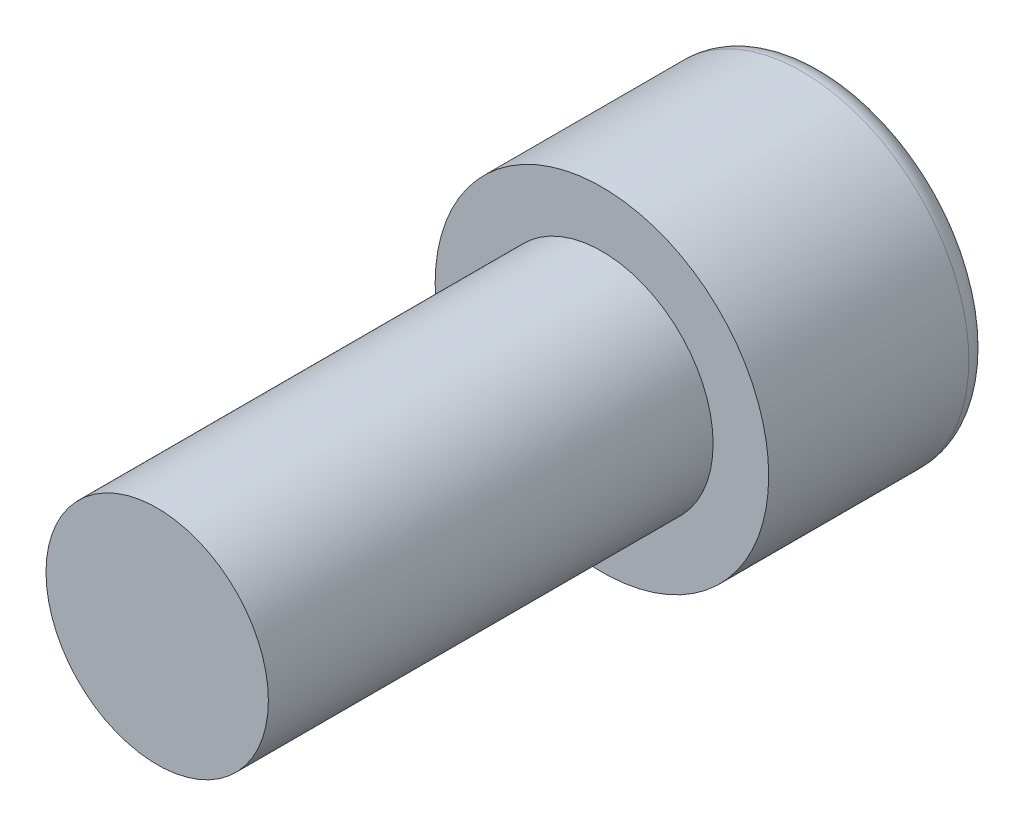
ISO-10303-21;
HEADER;
FILE_DESCRIPTION(('STEP AP214'),'2;1');
FILE_NAME('part.step','',(''),(''),'','','');
FILE_SCHEMA(('AUTOMOTIVE_DESIGN { 1 0 10303 214 1 1 1 1 }'));
ENDSEC;
DATA;
#1=APPLICATION_CONTEXT('core data for automotive mechanical design processes');
#2=APPLICATION_PROTOCOL_DEFINITION('international standard','automotive_design',2000,#1);
#3=PRODUCT_CONTEXT('',#1,'mechanical');
#4=PRODUCT('Part','Part','',(#3));
#5=PRODUCT_RELATED_PRODUCT_CATEGORY('part','',(#4));
#6=PRODUCT_DEFINITION_FORMATION('','',#4);
#7=PRODUCT_DEFINITION_CONTEXT('part definition',#1,'design');
#8=PRODUCT_DEFINITION('design','',#6,#7);
#9=PRODUCT_DEFINITION_SHAPE('','',#8);
#10=(LENGTH_UNIT() NAMED_UNIT(*) SI_UNIT(.MILLI.,.METRE.));
#11=(NAMED_UNIT(*) PLANE_ANGLE_UNIT() SI_UNIT($,.RADIAN.));
#12=(NAMED_UNIT(*) SI_UNIT($,.STERADIAN.) SOLID_ANGLE_UNIT());
#13=UNCERTAINTY_MEASURE_WITH_UNIT(LENGTH_MEASURE(1.E-05),#10,'distance_accuracy_value','');
#14=(GEOMETRIC_REPRESENTATION_CONTEXT(3) GLOBAL_UNCERTAINTY_ASSIGNED_CONTEXT((#13)) GLOBAL_UNIT_ASSIGNED_CONTEXT((#10,
#11,#12)) REPRESENTATION_CONTEXT('',''));
#15=CARTESIAN_POINT('',(0.,0.,0.));
#16=DIRECTION('',(0.,0.,1.));
#17=DIRECTION('',(1.,0.,0.));
#18=AXIS2_PLACEMENT_3D('',#15,#16,#17);
#19=CARTESIAN_POINT('',(0.,0.,4.));
#20=DIRECTION('',(0.,0.,-1.));
#21=DIRECTION('',(-1.,0.,0.));
#22=AXIS2_PLACEMENT_3D('',#19,#20,#21);
#23=CYLINDRICAL_SURFACE('',#22,1.);
#24=CARTESIAN_POINT('',(0.,0.,4.));
#25=DIRECTION('',(0.,0.,1.));
#26=DIRECTION('',(1.,0.,0.));
#27=AXIS2_PLACEMENT_3D('',#24,#25,#26);
#28=CIRCLE('',#27,1.);
#29=CARTESIAN_POINT('',(1.,0.,4.));
#30=VERTEX_POINT('',#29);
#31=EDGE_CURVE('E149',#30,#30,#28,.T.);
#32=ORIENTED_EDGE('',*,*,#31,.F.);
#33=EDGE_LOOP('',(#32));
#34=FACE_BOUND('',#33,.T.);
#35=CARTESIAN_POINT('',(0.,0.,0.));
#36=DIRECTION('',(0.,0.,1.));
#37=DIRECTION('',(1.,0.,0.));
#38=AXIS2_PLACEMENT_3D('',#35,#36,#37);
#39=CIRCLE('',#38,1.);
#40=CARTESIAN_POINT('',(1.,0.,0.));
#41=VERTEX_POINT('',#40);
#42=EDGE_CURVE('E148',#41,#41,#39,.T.);
#43=ORIENTED_EDGE('',*,*,#42,.T.);
#44=EDGE_LOOP('',(#43));
#45=FACE_BOUND('',#44,.T.);
#46=ADVANCED_FACE('F38',(#34,#45),#23,.T.);
#47=CARTESIAN_POINT('',(0.,0.,4.));
#48=DIRECTION('',(0.,0.,1.));
#49=DIRECTION('',(1.,0.,0.));
#50=AXIS2_PLACEMENT_3D('',#47,#48,#49);
#51=PLANE('',#50);
#52=ORIENTED_EDGE('',*,*,#31,.T.);
#53=EDGE_LOOP('',(#52));
#54=FACE_BOUND('',#53,.T.);
#55=ADVANCED_FACE('F172',(#54),#51,.T.);
#56=CARTESIAN_POINT('',(0.,0.,-2.));
#57=DIRECTION('',(0.,0.,1.));
#58=DIRECTION('',(1.,0.,0.));
#59=AXIS2_PLACEMENT_3D('',#56,#57,#58);
#60=CYLINDRICAL_SURFACE('',#59,1.5);
#61=CARTESIAN_POINT('',(0.,0.,-1.8));
#62=DIRECTION('',(0.,0.,-1.));
#63=DIRECTION('',(-1.,0.,0.));
#64=AXIS2_PLACEMENT_3D('',#61,#62,#63);
#65=CIRCLE('',#64,1.5);
#66=CARTESIAN_POINT('',(-1.5,0.,-1.8));
#67=VERTEX_POINT('',#66);
#68=EDGE_CURVE('E11',#67,#67,#65,.F.);
#69=ORIENTED_EDGE('',*,*,#68,.T.);
#70=EDGE_LOOP('',(#69));
#71=FACE_BOUND('',#70,.T.);
#72=CARTESIAN_POINT('',(0.,0.,0.));
#73=DIRECTION('',(0.,0.,-1.));
#74=DIRECTION('',(-1.,0.,0.));
#75=AXIS2_PLACEMENT_3D('',#72,#73,#74);
#76=CIRCLE('',#75,1.5);
#77=CARTESIAN_POINT('',(-1.5,0.,0.));
#78=VERTEX_POINT('',#77);
#79=EDGE_CURVE('E140',#78,#78,#76,.T.);
#80=ORIENTED_EDGE('',*,*,#79,.T.);
#81=EDGE_LOOP('',(#80));
#82=FACE_BOUND('',#81,.T.);
#83=ADVANCED_FACE('F177',(#71,#82),#60,.T.);
#84=CARTESIAN_POINT('',(0.,0.,-2.));
#85=DIRECTION('',(0.,0.,-1.));
#86=DIRECTION('',(-1.,0.,0.));
#87=AXIS2_PLACEMENT_3D('',#84,#85,#86);
#88=PLANE('',#87);
#89=DIRECTION('',(-0.866025403784439,-0.5,0.));
#90=VECTOR('',#89,1.);
#91=CARTESIAN_POINT('',(0.75,-0.433012701892219,-2.));
#92=LINE('',#91,#90);
#93=CARTESIAN_POINT('',(0.75,-0.433012701892219,-2.));
#94=VERTEX_POINT('',#93);
#95=CARTESIAN_POINT('',(0.,-0.866025403784439,-2.));
#96=VERTEX_POINT('',#95);
#97=EDGE_CURVE('E53',#94,#96,#92,.T.);
#98=ORIENTED_EDGE('',*,*,#97,.F.);
#99=DIRECTION('',(0.,-1.,0.));
#100=VECTOR('',#99,1.);
#101=CARTESIAN_POINT('',(0.75,0.433012701892219,-2.));
#102=LINE('',#101,#100);
#103=CARTESIAN_POINT('',(0.75,0.433012701892219,-2.));
#104=VERTEX_POINT('',#103);
#105=EDGE_CURVE('E136',#104,#94,#102,.T.);
#106=ORIENTED_EDGE('',*,*,#105,.F.);
#107=DIRECTION('',(0.866025403784439,-0.5,0.));
#108=VECTOR('',#107,1.);
#109=CARTESIAN_POINT('',(0.,0.866025403784439,-2.));
#110=LINE('',#109,#108);
#111=CARTESIAN_POINT('',(0.,0.866025403784439,-2.));
#112=VERTEX_POINT('',#111);
#113=EDGE_CURVE('E134',#112,#104,#110,.T.);
#114=ORIENTED_EDGE('',*,*,#113,.F.);
#115=DIRECTION('',(0.866025403784439,0.5,0.));
#116=VECTOR('',#115,1.);
#117=CARTESIAN_POINT('',(-0.75,0.43301270189222,-2.));
#118=LINE('',#117,#116);
#119=CARTESIAN_POINT('',(-0.75,0.43301270189222,-2.));
#120=VERTEX_POINT('',#119);
#121=EDGE_CURVE('E101',#120,#112,#118,.T.);
#122=ORIENTED_EDGE('',*,*,#121,.F.);
#123=DIRECTION('',(0.,1.,0.));
#124=VECTOR('',#123,1.);
#125=CARTESIAN_POINT('',(-0.75,-0.433012701892219,-2.));
#126=LINE('',#125,#124);
#127=CARTESIAN_POINT('',(-0.75,-0.433012701892219,-2.));
#128=VERTEX_POINT('',#127);
#129=EDGE_CURVE('E130',#128,#120,#126,.T.);
#130=ORIENTED_EDGE('',*,*,#129,.F.);
#131=DIRECTION('',(-0.866025403784438,0.5,0.));
#132=VECTOR('',#131,1.);
#133=CARTESIAN_POINT('',(0.,-0.866025403784439,-2.));
#134=LINE('',#133,#132);
#135=EDGE_CURVE('E127',#96,#128,#134,.T.);
#136=ORIENTED_EDGE('',*,*,#135,.F.);
#137=EDGE_LOOP('',(#98,#106,#114,#122,#130,#136));
#138=FACE_BOUND('',#137,.T.);
#139=CARTESIAN_POINT('',(0.,0.,-2.));
#140=DIRECTION('',(0.,0.,-1.));
#141=DIRECTION('',(-1.,0.,0.));
#142=AXIS2_PLACEMENT_3D('',#139,#140,#141);
#143=CIRCLE('',#142,1.3);
#144=CARTESIAN_POINT('',(-1.3,0.,-2.));
#145=VERTEX_POINT('',#144);
#146=EDGE_CURVE('E46',#145,#145,#143,.T.);
#147=ORIENTED_EDGE('',*,*,#146,.T.);
#148=EDGE_LOOP('',(#147));
#149=FACE_BOUND('',#148,.T.);
#150=ADVANCED_FACE('F156',(#138,#149),#88,.T.);
#151=CARTESIAN_POINT('',(0.,0.,0.));
#152=DIRECTION('',(0.,0.,-1.));
#153=DIRECTION('',(-1.,0.,0.));
#154=AXIS2_PLACEMENT_3D('',#151,#152,#153);
#155=PLANE('',#154);
#156=ORIENTED_EDGE('',*,*,#42,.F.);
#157=EDGE_LOOP('',(#156));
#158=FACE_BOUND('',#157,.T.);
#159=ORIENTED_EDGE('',*,*,#79,.F.);
#160=EDGE_LOOP('',(#159));
#161=FACE_BOUND('',#160,.T.);
#162=ADVANCED_FACE('F160',(#158,#161),#155,.F.);
#163=CARTESIAN_POINT('',(0.,0.,-1.8));
#164=DIRECTION('',(0.,0.,-1.));
#165=DIRECTION('',(-1.,0.,0.));
#166=AXIS2_PLACEMENT_3D('',#163,#164,#165);
#167=TOROIDAL_SURFACE('',#166,1.3,0.2);
#168=ORIENTED_EDGE('',*,*,#68,.F.);
#169=EDGE_LOOP('',(#168));
#170=FACE_BOUND('',#169,.T.);
#171=ORIENTED_EDGE('',*,*,#146,.F.);
#172=EDGE_LOOP('',(#171));
#173=FACE_BOUND('',#172,.T.);
#174=ADVANCED_FACE('F40',(#170,#173),#167,.T.);
#175=CARTESIAN_POINT('',(0.75,-0.433012701892219,-0.2));
#176=DIRECTION('',(0.5,-0.866025403784438,0.));
#177=DIRECTION('',(0.866025403784439,0.5,0.));
#178=AXIS2_PLACEMENT_3D('',#175,#176,#177);
#179=PLANE('',#178);
#180=ORIENTED_EDGE('',*,*,#97,.T.);
#181=DIRECTION('',(0.,0.,-1.));
#182=VECTOR('',#181,1.);
#183=CARTESIAN_POINT('',(0.,-0.866025403784439,-0.2));
#184=LINE('',#183,#182);
#185=CARTESIAN_POINT('',(0.,-0.866025403784439,-0.2));
#186=VERTEX_POINT('',#185);
#187=EDGE_CURVE('E83',#186,#96,#184,.T.);
#188=ORIENTED_EDGE('',*,*,#187,.F.);
#189=DIRECTION('',(-0.866025403784439,-0.5,0.));
#190=VECTOR('',#189,1.);
#191=CARTESIAN_POINT('',(0.75,-0.433012701892219,-0.2));
#192=LINE('',#191,#190);
#193=CARTESIAN_POINT('',(0.75,-0.433012701892219,-0.2));
#194=VERTEX_POINT('',#193);
#195=EDGE_CURVE('E138',#194,#186,#192,.T.);
#196=ORIENTED_EDGE('',*,*,#195,.F.);
#197=DIRECTION('',(0.,0.,-1.));
#198=VECTOR('',#197,1.);
#199=CARTESIAN_POINT('',(0.75,-0.433012701892219,-0.2));
#200=LINE('',#199,#198);
#201=EDGE_CURVE('E61',#194,#94,#200,.T.);
#202=ORIENTED_EDGE('',*,*,#201,.T.);
#203=EDGE_LOOP('',(#180,#188,#196,#202));
#204=FACE_BOUND('',#203,.T.);
#205=ADVANCED_FACE('F159',(#204),#179,.F.);
#206=CARTESIAN_POINT('',(0.75,0.433012701892219,-0.2));
#207=DIRECTION('',(1.,0.,0.));
#208=DIRECTION('',(0.,1.,0.));
#209=AXIS2_PLACEMENT_3D('',#206,#207,#208);
#210=PLANE('',#209);
#211=ORIENTED_EDGE('',*,*,#105,.T.);
#212=ORIENTED_EDGE('',*,*,#201,.F.);
#213=DIRECTION('',(0.,-1.,0.));
#214=VECTOR('',#213,1.);
#215=CARTESIAN_POINT('',(0.75,0.433012701892219,-0.2));
#216=LINE('',#215,#214);
#217=CARTESIAN_POINT('',(0.75,0.433012701892219,-0.2));
#218=VERTEX_POINT('',#217);
#219=EDGE_CURVE('E113',#218,#194,#216,.T.);
#220=ORIENTED_EDGE('',*,*,#219,.F.);
#221=DIRECTION('',(0.,0.,-1.));
#222=VECTOR('',#221,1.);
#223=CARTESIAN_POINT('',(0.75,0.433012701892219,-0.2));
#224=LINE('',#223,#222);
#225=EDGE_CURVE('E105',#218,#104,#224,.T.);
#226=ORIENTED_EDGE('',*,*,#225,.T.);
#227=EDGE_LOOP('',(#211,#212,#220,#226));
#228=FACE_BOUND('',#227,.T.);
#229=ADVANCED_FACE('F166',(#228),#210,.F.);
#230=CARTESIAN_POINT('',(0.,0.866025403784439,-0.2));
#231=DIRECTION('',(0.5,0.866025403784438,0.));
#232=DIRECTION('',(-0.866025403784439,0.5,0.));
#233=AXIS2_PLACEMENT_3D('',#230,#231,#232);
#234=PLANE('',#233);
#235=ORIENTED_EDGE('',*,*,#113,.T.);
#236=ORIENTED_EDGE('',*,*,#225,.F.);
#237=DIRECTION('',(0.866025403784439,-0.5,0.));
#238=VECTOR('',#237,1.);
#239=CARTESIAN_POINT('',(0.,0.866025403784439,-0.2));
#240=LINE('',#239,#238);
#241=CARTESIAN_POINT('',(0.,0.866025403784439,-0.2));
#242=VERTEX_POINT('',#241);
#243=EDGE_CURVE('E109',#242,#218,#240,.T.);
#244=ORIENTED_EDGE('',*,*,#243,.F.);
#245=DIRECTION('',(0.,0.,-1.));
#246=VECTOR('',#245,1.);
#247=CARTESIAN_POINT('',(0.,0.866025403784439,-0.2));
#248=LINE('',#247,#246);
#249=EDGE_CURVE('E94',#242,#112,#248,.T.);
#250=ORIENTED_EDGE('',*,*,#249,.T.);
#251=EDGE_LOOP('',(#235,#236,#244,#250));
#252=FACE_BOUND('',#251,.T.);
#253=ADVANCED_FACE('F110',(#252),#234,.F.);
#254=CARTESIAN_POINT('',(-0.75,0.43301270189222,-0.2));
#255=DIRECTION('',(-0.5,0.866025403784439,0.));
#256=DIRECTION('',(-0.866025403784439,-0.5,0.));
#257=AXIS2_PLACEMENT_3D('',#254,#255,#256);
#258=PLANE('',#257);
#259=ORIENTED_EDGE('',*,*,#121,.T.);
#260=ORIENTED_EDGE('',*,*,#249,.F.);
#261=DIRECTION('',(0.866025403784439,0.5,0.));
#262=VECTOR('',#261,1.);
#263=CARTESIAN_POINT('',(-0.75,0.43301270189222,-0.2));
#264=LINE('',#263,#262);
#265=CARTESIAN_POINT('',(-0.75,0.43301270189222,-0.2));
#266=VERTEX_POINT('',#265);
#267=EDGE_CURVE('E98',#266,#242,#264,.T.);
#268=ORIENTED_EDGE('',*,*,#267,.F.);
#269=DIRECTION('',(0.,0.,-1.));
#270=VECTOR('',#269,1.);
#271=CARTESIAN_POINT('',(-0.75,0.43301270189222,-0.2));
#272=LINE('',#271,#270);
#273=EDGE_CURVE('E106',#266,#120,#272,.T.);
#274=ORIENTED_EDGE('',*,*,#273,.T.);
#275=EDGE_LOOP('',(#259,#260,#268,#274));
#276=FACE_BOUND('',#275,.T.);
#277=ADVANCED_FACE('F96',(#276),#258,.F.);
#278=CARTESIAN_POINT('',(-0.75,-0.433012701892219,-0.2));
#279=DIRECTION('',(-1.,0.,0.));
#280=DIRECTION('',(0.,0.,1.));
#281=AXIS2_PLACEMENT_3D('',#278,#279,#280);
#282=PLANE('',#281);
#283=ORIENTED_EDGE('',*,*,#129,.T.);
#284=ORIENTED_EDGE('',*,*,#273,.F.);
#285=DIRECTION('',(0.,1.,0.));
#286=VECTOR('',#285,1.);
#287=CARTESIAN_POINT('',(-0.75,-0.433012701892219,-0.2));
#288=LINE('',#287,#286);
#289=CARTESIAN_POINT('',(-0.75,-0.433012701892219,-0.2));
#290=VERTEX_POINT('',#289);
#291=EDGE_CURVE('E119',#290,#266,#288,.T.);
#292=ORIENTED_EDGE('',*,*,#291,.F.);
#293=DIRECTION('',(0.,0.,-1.));
#294=VECTOR('',#293,1.);
#295=CARTESIAN_POINT('',(-0.75,-0.433012701892219,-0.2));
#296=LINE('',#295,#294);
#297=EDGE_CURVE('E143',#290,#128,#296,.T.);
#298=ORIENTED_EDGE('',*,*,#297,.T.);
#299=EDGE_LOOP('',(#283,#284,#292,#298));
#300=FACE_BOUND('',#299,.T.);
#301=ADVANCED_FACE('F192',(#300),#282,.F.);
#302=CARTESIAN_POINT('',(0.,-0.866025403784439,-0.2));
#303=DIRECTION('',(-0.5,-0.866025403784438,0.));
#304=DIRECTION('',(0.866025403784439,-0.5,0.));
#305=AXIS2_PLACEMENT_3D('',#302,#303,#304);
#306=PLANE('',#305);
#307=ORIENTED_EDGE('',*,*,#135,.T.);
#308=ORIENTED_EDGE('',*,*,#297,.F.);
#309=DIRECTION('',(-0.866025403784438,0.5,0.));
#310=VECTOR('',#309,1.);
#311=CARTESIAN_POINT('',(0.,-0.866025403784439,-0.2));
#312=LINE('',#311,#310);
#313=EDGE_CURVE('E121',#186,#290,#312,.T.);
#314=ORIENTED_EDGE('',*,*,#313,.F.);
#315=ORIENTED_EDGE('',*,*,#187,.T.);
#316=EDGE_LOOP('',(#307,#308,#314,#315));
#317=FACE_BOUND('',#316,.T.);
#318=ADVANCED_FACE('F189',(#317),#306,.F.);
#319=CARTESIAN_POINT('',(0.,0.,-0.2));
#320=DIRECTION('',(0.,0.,-1.));
#321=DIRECTION('',(-1.,0.,0.));
#322=AXIS2_PLACEMENT_3D('',#319,#320,#321);
#323=PLANE('',#322);
#324=ORIENTED_EDGE('',*,*,#195,.T.);
#325=ORIENTED_EDGE('',*,*,#313,.T.);
#326=ORIENTED_EDGE('',*,*,#291,.T.);
#327=ORIENTED_EDGE('',*,*,#267,.T.);
#328=ORIENTED_EDGE('',*,*,#243,.T.);
#329=ORIENTED_EDGE('',*,*,#219,.T.);
#330=EDGE_LOOP('',(#324,#325,#326,#327,#328,#329));
#331=FACE_BOUND('',#330,.T.);
#332=ADVANCED_FACE('F116',(#331),#323,.T.);
#333=CLOSED_SHELL('',(#46,#55,#83,#150,#162,#174,#205,#229,#253,#277,#301,#318,#332));
#334=MANIFOLD_SOLID_BREP('B2',#333);
#335=ADVANCED_BREP_SHAPE_REPRESENTATION('',(#18,#334),#14);
#336=SHAPE_DEFINITION_REPRESENTATION(#9,#335);
ENDSEC;
END-ISO-10303-21;
